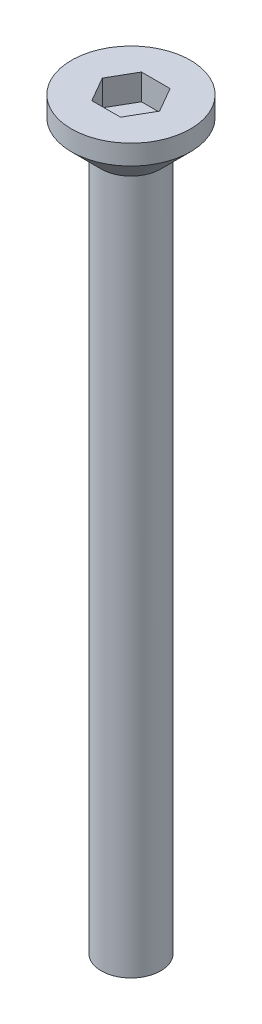
ISO-10303-21;
HEADER;
FILE_DESCRIPTION(('STEP AP214'),'2;1');
FILE_NAME('part.step','',(''),(''),'','','');
FILE_SCHEMA(('AUTOMOTIVE_DESIGN { 1 0 10303 214 1 1 1 1 }'));
ENDSEC;
DATA;
#1=APPLICATION_CONTEXT('core data for automotive mechanical design processes');
#2=APPLICATION_PROTOCOL_DEFINITION('international standard','automotive_design',2000,#1);
#3=PRODUCT_CONTEXT('',#1,'mechanical');
#4=PRODUCT('Part','Part','',(#3));
#5=PRODUCT_RELATED_PRODUCT_CATEGORY('part','',(#4));
#6=PRODUCT_DEFINITION_FORMATION('','',#4);
#7=PRODUCT_DEFINITION_CONTEXT('part definition',#1,'design');
#8=PRODUCT_DEFINITION('design','',#6,#7);
#9=PRODUCT_DEFINITION_SHAPE('','',#8);
#10=(LENGTH_UNIT() NAMED_UNIT(*) SI_UNIT(.MILLI.,.METRE.));
#11=(NAMED_UNIT(*) PLANE_ANGLE_UNIT() SI_UNIT($,.RADIAN.));
#12=(NAMED_UNIT(*) SI_UNIT($,.STERADIAN.) SOLID_ANGLE_UNIT());
#13=UNCERTAINTY_MEASURE_WITH_UNIT(LENGTH_MEASURE(1.E-05),#10,'distance_accuracy_value','');
#14=(GEOMETRIC_REPRESENTATION_CONTEXT(3) GLOBAL_UNCERTAINTY_ASSIGNED_CONTEXT((#13)) GLOBAL_UNIT_ASSIGNED_CONTEXT((#10,
#11,#12)) REPRESENTATION_CONTEXT('',''));
#15=CARTESIAN_POINT('',(0.,0.,0.));
#16=DIRECTION('',(0.,0.,1.));
#17=DIRECTION('',(1.,0.,0.));
#18=AXIS2_PLACEMENT_3D('',#15,#16,#17);
#19=CARTESIAN_POINT('',(0.,2.5,0.));
#20=DIRECTION('',(0.,-1.,0.));
#21=DIRECTION('',(0.,0.,-1.));
#22=AXIS2_PLACEMENT_3D('',#19,#20,#21);
#23=CYLINDRICAL_SURFACE('',#22,3.);
#24=CARTESIAN_POINT('',(0.,1.5,0.));
#25=DIRECTION('',(0.,1.,0.));
#26=DIRECTION('',(0.,0.,1.));
#27=AXIS2_PLACEMENT_3D('',#24,#25,#26);
#28=CIRCLE('',#27,3.);
#29=CARTESIAN_POINT('',(0.,1.5,3.));
#30=VERTEX_POINT('',#29);
#31=EDGE_CURVE('E45',#30,#30,#28,.T.);
#32=ORIENTED_EDGE('',*,*,#31,.T.);
#33=EDGE_LOOP('',(#32));
#34=FACE_BOUND('',#33,.T.);
#35=CARTESIAN_POINT('',(0.,2.5,0.));
#36=DIRECTION('',(0.,1.,0.));
#37=DIRECTION('',(0.,0.,1.));
#38=AXIS2_PLACEMENT_3D('',#35,#36,#37);
#39=CIRCLE('',#38,3.);
#40=CARTESIAN_POINT('',(0.,2.5,3.));
#41=VERTEX_POINT('',#40);
#42=EDGE_CURVE('E140',#41,#41,#39,.T.);
#43=ORIENTED_EDGE('',*,*,#42,.F.);
#44=EDGE_LOOP('',(#43));
#45=FACE_BOUND('',#44,.T.);
#46=ADVANCED_FACE('F37',(#34,#45),#23,.T.);
#47=CARTESIAN_POINT('',(0.,2.5,0.));
#48=DIRECTION('',(0.,1.,0.));
#49=DIRECTION('',(0.,0.,1.));
#50=AXIS2_PLACEMENT_3D('',#47,#48,#49);
#51=PLANE('',#50);
#52=DIRECTION('',(0.5,0.,-0.866025403784439));
#53=VECTOR('',#52,1.);
#54=CARTESIAN_POINT('',(0.721687836487032,2.5,1.25));
#55=LINE('',#54,#53);
#56=CARTESIAN_POINT('',(0.721687836487032,2.5,1.25));
#57=VERTEX_POINT('',#56);
#58=CARTESIAN_POINT('',(1.44337567297406,2.5,0.));
#59=VERTEX_POINT('',#58);
#60=EDGE_CURVE('E52',#57,#59,#55,.T.);
#61=ORIENTED_EDGE('',*,*,#60,.F.);
#62=DIRECTION('',(1.,0.,0.));
#63=VECTOR('',#62,1.);
#64=CARTESIAN_POINT('',(-0.721687836487033,2.5,1.25));
#65=LINE('',#64,#63);
#66=CARTESIAN_POINT('',(-0.721687836487033,2.5,1.25));
#67=VERTEX_POINT('',#66);
#68=EDGE_CURVE('E136',#67,#57,#65,.T.);
#69=ORIENTED_EDGE('',*,*,#68,.F.);
#70=DIRECTION('',(0.5,0.,0.866025403784439));
#71=VECTOR('',#70,1.);
#72=CARTESIAN_POINT('',(-1.44337567297407,2.5,0.));
#73=LINE('',#72,#71);
#74=CARTESIAN_POINT('',(-1.44337567297407,2.5,0.));
#75=VERTEX_POINT('',#74);
#76=EDGE_CURVE('E134',#75,#67,#73,.T.);
#77=ORIENTED_EDGE('',*,*,#76,.F.);
#78=DIRECTION('',(-0.5,0.,0.866025403784438));
#79=VECTOR('',#78,1.);
#80=CARTESIAN_POINT('',(-0.721687836487033,2.5,-1.25));
#81=LINE('',#80,#79);
#82=CARTESIAN_POINT('',(-0.721687836487033,2.5,-1.25));
#83=VERTEX_POINT('',#82);
#84=EDGE_CURVE('E100',#83,#75,#81,.T.);
#85=ORIENTED_EDGE('',*,*,#84,.F.);
#86=DIRECTION('',(-1.,0.,0.));
#87=VECTOR('',#86,1.);
#88=CARTESIAN_POINT('',(0.721687836487032,2.5,-1.25));
#89=LINE('',#88,#87);
#90=CARTESIAN_POINT('',(0.721687836487032,2.5,-1.25));
#91=VERTEX_POINT('',#90);
#92=EDGE_CURVE('E130',#91,#83,#89,.T.);
#93=ORIENTED_EDGE('',*,*,#92,.F.);
#94=DIRECTION('',(-0.5,0.,-0.866025403784439));
#95=VECTOR('',#94,1.);
#96=CARTESIAN_POINT('',(1.44337567297406,2.5,0.));
#97=LINE('',#96,#95);
#98=EDGE_CURVE('E126',#59,#91,#97,.T.);
#99=ORIENTED_EDGE('',*,*,#98,.F.);
#100=EDGE_LOOP('',(#61,#69,#77,#85,#93,#99));
#101=FACE_BOUND('',#100,.T.);
#102=ORIENTED_EDGE('',*,*,#42,.T.);
#103=EDGE_LOOP('',(#102));
#104=FACE_BOUND('',#103,.T.);
#105=ADVANCED_FACE('F154',(#101,#104),#51,.T.);
#106=CARTESIAN_POINT('',(0.,1.5,0.));
#107=DIRECTION('',(0.,1.,0.));
#108=DIRECTION('',(0.,0.,1.));
#109=AXIS2_PLACEMENT_3D('',#106,#107,#108);
#110=CONICAL_SURFACE('',#109,3.,0.78539816339745);
#111=CARTESIAN_POINT('',(0.,0.,0.));
#112=DIRECTION('',(0.,1.,0.));
#113=DIRECTION('',(0.,0.,1.));
#114=AXIS2_PLACEMENT_3D('',#111,#112,#113);
#115=CIRCLE('',#114,1.49999999999999);
#116=CARTESIAN_POINT('',(0.,0.,1.49999999999999));
#117=VERTEX_POINT('',#116);
#118=EDGE_CURVE('E11',#117,#117,#115,.F.);
#119=ORIENTED_EDGE('',*,*,#118,.F.);
#120=EDGE_LOOP('',(#119));
#121=FACE_BOUND('',#120,.T.);
#122=ORIENTED_EDGE('',*,*,#31,.F.);
#123=EDGE_LOOP('',(#122));
#124=FACE_BOUND('',#123,.T.);
#125=ADVANCED_FACE('F39',(#121,#124),#110,.T.);
#126=CARTESIAN_POINT('',(0.721687836487032,1.2,1.25));
#127=DIRECTION('',(0.866025403784439,0.,0.5));
#128=DIRECTION('',(0.5,0.,-0.866025403784439));
#129=AXIS2_PLACEMENT_3D('',#126,#127,#128);
#130=PLANE('',#129);
#131=ORIENTED_EDGE('',*,*,#60,.T.);
#132=DIRECTION('',(0.,1.,0.));
#133=VECTOR('',#132,1.);
#134=CARTESIAN_POINT('',(1.44337567297406,1.2,0.));
#135=LINE('',#134,#133);
#136=CARTESIAN_POINT('',(1.44337567297406,1.2,0.));
#137=VERTEX_POINT('',#136);
#138=EDGE_CURVE('E82',#137,#59,#135,.T.);
#139=ORIENTED_EDGE('',*,*,#138,.F.);
#140=DIRECTION('',(0.5,0.,-0.866025403784439));
#141=VECTOR('',#140,1.);
#142=CARTESIAN_POINT('',(0.721687836487032,1.2,1.25));
#143=LINE('',#142,#141);
#144=CARTESIAN_POINT('',(0.721687836487032,1.2,1.25));
#145=VERTEX_POINT('',#144);
#146=EDGE_CURVE('E138',#145,#137,#143,.T.);
#147=ORIENTED_EDGE('',*,*,#146,.F.);
#148=DIRECTION('',(0.,1.,0.));
#149=VECTOR('',#148,1.);
#150=CARTESIAN_POINT('',(0.721687836487032,1.2,1.25));
#151=LINE('',#150,#149);
#152=EDGE_CURVE('E60',#145,#57,#151,.T.);
#153=ORIENTED_EDGE('',*,*,#152,.T.);
#154=EDGE_LOOP('',(#131,#139,#147,#153));
#155=FACE_BOUND('',#154,.T.);
#156=ADVANCED_FACE('F153',(#155),#130,.F.);
#157=CARTESIAN_POINT('',(-0.721687836487033,1.2,1.25));
#158=DIRECTION('',(0.,0.,1.));
#159=DIRECTION('',(1.,0.,0.));
#160=AXIS2_PLACEMENT_3D('',#157,#158,#159);
#161=PLANE('',#160);
#162=ORIENTED_EDGE('',*,*,#68,.T.);
#163=ORIENTED_EDGE('',*,*,#152,.F.);
#164=DIRECTION('',(1.,0.,0.));
#165=VECTOR('',#164,1.);
#166=CARTESIAN_POINT('',(-0.721687836487033,1.2,1.25));
#167=LINE('',#166,#165);
#168=CARTESIAN_POINT('',(-0.721687836487033,1.2,1.25));
#169=VERTEX_POINT('',#168);
#170=EDGE_CURVE('E112',#169,#145,#167,.T.);
#171=ORIENTED_EDGE('',*,*,#170,.F.);
#172=DIRECTION('',(0.,1.,0.));
#173=VECTOR('',#172,1.);
#174=CARTESIAN_POINT('',(-0.721687836487033,1.2,1.25));
#175=LINE('',#174,#173);
#176=EDGE_CURVE('E104',#169,#67,#175,.T.);
#177=ORIENTED_EDGE('',*,*,#176,.T.);
#178=EDGE_LOOP('',(#162,#163,#171,#177));
#179=FACE_BOUND('',#178,.T.);
#180=ADVANCED_FACE('F160',(#179),#161,.F.);
#181=CARTESIAN_POINT('',(-1.44337567297407,1.2,0.));
#182=DIRECTION('',(-0.866025403784439,0.,0.5));
#183=DIRECTION('',(0.5,0.,0.866025403784439));
#184=AXIS2_PLACEMENT_3D('',#181,#182,#183);
#185=PLANE('',#184);
#186=ORIENTED_EDGE('',*,*,#76,.T.);
#187=ORIENTED_EDGE('',*,*,#176,.F.);
#188=DIRECTION('',(0.5,0.,0.866025403784439));
#189=VECTOR('',#188,1.);
#190=CARTESIAN_POINT('',(-1.44337567297407,1.2,0.));
#191=LINE('',#190,#189);
#192=CARTESIAN_POINT('',(-1.44337567297407,1.2,0.));
#193=VERTEX_POINT('',#192);
#194=EDGE_CURVE('E108',#193,#169,#191,.T.);
#195=ORIENTED_EDGE('',*,*,#194,.F.);
#196=DIRECTION('',(0.,1.,0.));
#197=VECTOR('',#196,1.);
#198=CARTESIAN_POINT('',(-1.44337567297407,1.2,0.));
#199=LINE('',#198,#197);
#200=EDGE_CURVE('E93',#193,#75,#199,.T.);
#201=ORIENTED_EDGE('',*,*,#200,.T.);
#202=EDGE_LOOP('',(#186,#187,#195,#201));
#203=FACE_BOUND('',#202,.T.);
#204=ADVANCED_FACE('F109',(#203),#185,.F.);
#205=CARTESIAN_POINT('',(-0.721687836487033,1.2,-1.25));
#206=DIRECTION('',(-0.866025403784439,0.,-0.5));
#207=DIRECTION('',(-0.5,0.,0.866025403784439));
#208=AXIS2_PLACEMENT_3D('',#205,#206,#207);
#209=PLANE('',#208);
#210=ORIENTED_EDGE('',*,*,#84,.T.);
#211=ORIENTED_EDGE('',*,*,#200,.F.);
#212=DIRECTION('',(-0.5,0.,0.866025403784438));
#213=VECTOR('',#212,1.);
#214=CARTESIAN_POINT('',(-0.721687836487033,1.2,-1.25));
#215=LINE('',#214,#213);
#216=CARTESIAN_POINT('',(-0.721687836487033,1.2,-1.25));
#217=VERTEX_POINT('',#216);
#218=EDGE_CURVE('E97',#217,#193,#215,.T.);
#219=ORIENTED_EDGE('',*,*,#218,.F.);
#220=DIRECTION('',(0.,1.,0.));
#221=VECTOR('',#220,1.);
#222=CARTESIAN_POINT('',(-0.721687836487033,1.2,-1.25));
#223=LINE('',#222,#221);
#224=EDGE_CURVE('E105',#217,#83,#223,.T.);
#225=ORIENTED_EDGE('',*,*,#224,.T.);
#226=EDGE_LOOP('',(#210,#211,#219,#225));
#227=FACE_BOUND('',#226,.T.);
#228=ADVANCED_FACE('F95',(#227),#209,.F.);
#229=CARTESIAN_POINT('',(0.721687836487032,1.2,-1.25));
#230=DIRECTION('',(0.,0.,-1.));
#231=DIRECTION('',(-1.,0.,0.));
#232=AXIS2_PLACEMENT_3D('',#229,#230,#231);
#233=PLANE('',#232);
#234=ORIENTED_EDGE('',*,*,#92,.T.);
#235=ORIENTED_EDGE('',*,*,#224,.F.);
#236=DIRECTION('',(-1.,0.,0.));
#237=VECTOR('',#236,1.);
#238=CARTESIAN_POINT('',(0.721687836487032,1.2,-1.25));
#239=LINE('',#238,#237);
#240=CARTESIAN_POINT('',(0.721687836487032,1.2,-1.25));
#241=VERTEX_POINT('',#240);
#242=EDGE_CURVE('E118',#241,#217,#239,.T.);
#243=ORIENTED_EDGE('',*,*,#242,.F.);
#244=DIRECTION('',(0.,1.,0.));
#245=VECTOR('',#244,1.);
#246=CARTESIAN_POINT('',(0.721687836487032,1.2,-1.25));
#247=LINE('',#246,#245);
#248=EDGE_CURVE('E143',#241,#91,#247,.T.);
#249=ORIENTED_EDGE('',*,*,#248,.T.);
#250=EDGE_LOOP('',(#234,#235,#243,#249));
#251=FACE_BOUND('',#250,.T.);
#252=ADVANCED_FACE('F172',(#251),#233,.F.);
#253=CARTESIAN_POINT('',(1.44337567297406,1.2,0.));
#254=DIRECTION('',(0.866025403784439,0.,-0.5));
#255=DIRECTION('',(-0.5,0.,-0.866025403784439));
#256=AXIS2_PLACEMENT_3D('',#253,#254,#255);
#257=PLANE('',#256);
#258=ORIENTED_EDGE('',*,*,#98,.T.);
#259=ORIENTED_EDGE('',*,*,#248,.F.);
#260=DIRECTION('',(-0.5,0.,-0.866025403784439));
#261=VECTOR('',#260,1.);
#262=CARTESIAN_POINT('',(1.44337567297406,1.2,0.));
#263=LINE('',#262,#261);
#264=EDGE_CURVE('E120',#137,#241,#263,.T.);
#265=ORIENTED_EDGE('',*,*,#264,.F.);
#266=ORIENTED_EDGE('',*,*,#138,.T.);
#267=EDGE_LOOP('',(#258,#259,#265,#266));
#268=FACE_BOUND('',#267,.T.);
#269=ADVANCED_FACE('F169',(#268),#257,.F.);
#270=CARTESIAN_POINT('',(0.,1.2,0.));
#271=DIRECTION('',(0.,1.,0.));
#272=DIRECTION('',(0.,0.,1.));
#273=AXIS2_PLACEMENT_3D('',#270,#271,#272);
#274=PLANE('',#273);
#275=ORIENTED_EDGE('',*,*,#146,.T.);
#276=ORIENTED_EDGE('',*,*,#264,.T.);
#277=ORIENTED_EDGE('',*,*,#242,.T.);
#278=ORIENTED_EDGE('',*,*,#218,.T.);
#279=ORIENTED_EDGE('',*,*,#194,.T.);
#280=ORIENTED_EDGE('',*,*,#170,.T.);
#281=EDGE_LOOP('',(#275,#276,#277,#278,#279,#280));
#282=FACE_BOUND('',#281,.T.);
#283=ADVANCED_FACE('F115',(#282),#274,.T.);
#284=CARTESIAN_POINT('',(0.,-35.,0.));
#285=DIRECTION('',(0.,1.,0.));
#286=DIRECTION('',(0.,0.,1.));
#287=AXIS2_PLACEMENT_3D('',#284,#285,#286);
#288=CYLINDRICAL_SURFACE('',#287,1.5);
#289=CARTESIAN_POINT('',(0.,-35.,0.));
#290=DIRECTION('',(0.,-1.,0.));
#291=DIRECTION('',(0.,0.,-1.));
#292=AXIS2_PLACEMENT_3D('',#289,#290,#291);
#293=CIRCLE('',#292,1.5);
#294=CARTESIAN_POINT('',(0.,-35.,-1.5));
#295=VERTEX_POINT('',#294);
#296=EDGE_CURVE('E127',#295,#295,#293,.T.);
#297=ORIENTED_EDGE('',*,*,#296,.F.);
#298=EDGE_LOOP('',(#297));
#299=FACE_BOUND('',#298,.T.);
#300=ORIENTED_EDGE('',*,*,#118,.T.);
#301=EDGE_LOOP('',(#300));
#302=FACE_BOUND('',#301,.T.);
#303=ADVANCED_FACE('F185',(#299,#302),#288,.T.);
#304=CARTESIAN_POINT('',(0.,-35.,0.));
#305=DIRECTION('',(0.,-1.,0.));
#306=DIRECTION('',(0.,0.,-1.));
#307=AXIS2_PLACEMENT_3D('',#304,#305,#306);
#308=PLANE('',#307);
#309=ORIENTED_EDGE('',*,*,#296,.T.);
#310=EDGE_LOOP('',(#309));
#311=FACE_BOUND('',#310,.T.);
#312=ADVANCED_FACE('F188',(#311),#308,.T.);
#313=CLOSED_SHELL('',(#46,#105,#125,#156,#180,#204,#228,#252,#269,#283,#303,#312));
#314=MANIFOLD_SOLID_BREP('B2',#313);
#315=ADVANCED_BREP_SHAPE_REPRESENTATION('',(#18,#314),#14);
#316=SHAPE_DEFINITION_REPRESENTATION(#9,#315);
ENDSEC;
END-ISO-10303-21;
